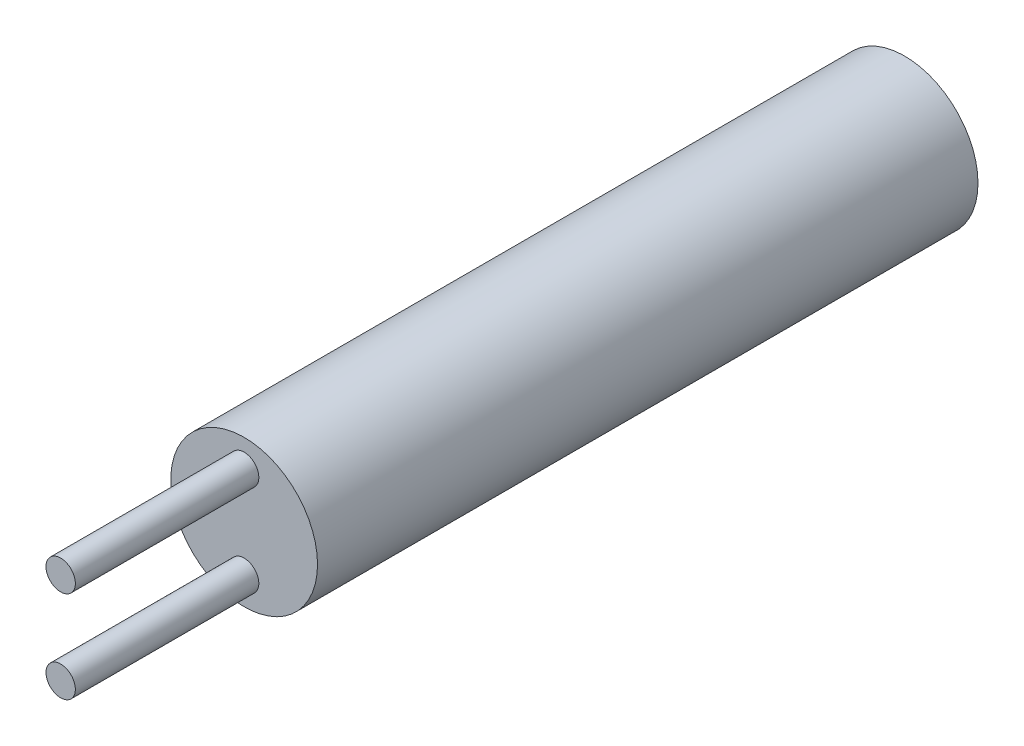
ISO-10303-21;
HEADER;
FILE_DESCRIPTION(('STEP AP214'),'2;1');
FILE_NAME('part.step','',(''),(''),'','','');
FILE_SCHEMA(('AUTOMOTIVE_DESIGN { 1 0 10303 214 1 1 1 1 }'));
ENDSEC;
DATA;
#1=APPLICATION_CONTEXT('core data for automotive mechanical design processes');
#2=APPLICATION_PROTOCOL_DEFINITION('international standard','automotive_design',2000,#1);
#3=PRODUCT_CONTEXT('',#1,'mechanical');
#4=PRODUCT('Part','Part','',(#3));
#5=PRODUCT_RELATED_PRODUCT_CATEGORY('part','',(#4));
#6=PRODUCT_DEFINITION_FORMATION('','',#4);
#7=PRODUCT_DEFINITION_CONTEXT('part definition',#1,'design');
#8=PRODUCT_DEFINITION('design','',#6,#7);
#9=PRODUCT_DEFINITION_SHAPE('','',#8);
#10=(LENGTH_UNIT() NAMED_UNIT(*) SI_UNIT(.MILLI.,.METRE.));
#11=(NAMED_UNIT(*) PLANE_ANGLE_UNIT() SI_UNIT($,.RADIAN.));
#12=(NAMED_UNIT(*) SI_UNIT($,.STERADIAN.) SOLID_ANGLE_UNIT());
#13=UNCERTAINTY_MEASURE_WITH_UNIT(LENGTH_MEASURE(1.E-05),#10,'distance_accuracy_value','');
#14=(GEOMETRIC_REPRESENTATION_CONTEXT(3) GLOBAL_UNCERTAINTY_ASSIGNED_CONTEXT((#13)) GLOBAL_UNIT_ASSIGNED_CONTEXT((#10,
#11,#12)) REPRESENTATION_CONTEXT('',''));
#15=CARTESIAN_POINT('',(0.,0.,0.));
#16=DIRECTION('',(0.,0.,1.));
#17=DIRECTION('',(1.,0.,0.));
#18=AXIS2_PLACEMENT_3D('',#15,#16,#17);
#19=CARTESIAN_POINT('',(0.,0.,18.));
#20=DIRECTION('',(0.,0.,-1.));
#21=DIRECTION('',(-1.,0.,0.));
#22=AXIS2_PLACEMENT_3D('',#19,#20,#21);
#23=CYLINDRICAL_SURFACE('',#22,2.);
#24=CARTESIAN_POINT('',(0.,0.,18.));
#25=DIRECTION('',(0.,0.,1.));
#26=DIRECTION('',(1.,0.,0.));
#27=AXIS2_PLACEMENT_3D('',#24,#25,#26);
#28=CIRCLE('',#27,2.);
#29=CARTESIAN_POINT('',(2.,0.,18.));
#30=VERTEX_POINT('',#29);
#31=EDGE_CURVE('E10',#30,#30,#28,.T.);
#32=ORIENTED_EDGE('',*,*,#31,.F.);
#33=EDGE_LOOP('',(#32));
#34=FACE_BOUND('',#33,.T.);
#35=CARTESIAN_POINT('',(0.,0.,0.));
#36=DIRECTION('',(0.,0.,1.));
#37=DIRECTION('',(1.,0.,0.));
#38=AXIS2_PLACEMENT_3D('',#35,#36,#37);
#39=CIRCLE('',#38,2.);
#40=CARTESIAN_POINT('',(2.,0.,0.));
#41=VERTEX_POINT('',#40);
#42=EDGE_CURVE('E42',#41,#41,#39,.T.);
#43=ORIENTED_EDGE('',*,*,#42,.T.);
#44=EDGE_LOOP('',(#43));
#45=FACE_BOUND('',#44,.T.);
#46=ADVANCED_FACE('F39',(#34,#45),#23,.T.);
#47=CARTESIAN_POINT('',(0.,0.,18.));
#48=DIRECTION('',(0.,0.,1.));
#49=DIRECTION('',(1.,0.,0.));
#50=AXIS2_PLACEMENT_3D('',#47,#48,#49);
#51=PLANE('',#50);
#52=CARTESIAN_POINT('',(0.,-1.25,18.));
#53=DIRECTION('',(0.,0.,1.));
#54=DIRECTION('',(-1.,0.,0.));
#55=AXIS2_PLACEMENT_3D('',#52,#53,#54);
#56=CIRCLE('',#55,0.4);
#57=CARTESIAN_POINT('',(-0.4,-1.25,18.));
#58=VERTEX_POINT('',#57);
#59=EDGE_CURVE('E61',#58,#58,#56,.T.);
#60=ORIENTED_EDGE('',*,*,#59,.F.);
#61=EDGE_LOOP('',(#60));
#62=FACE_BOUND('',#61,.T.);
#63=CARTESIAN_POINT('',(0.,1.25,18.));
#64=DIRECTION('',(0.,0.,1.));
#65=DIRECTION('',(1.,0.,0.));
#66=AXIS2_PLACEMENT_3D('',#63,#64,#65);
#67=CIRCLE('',#66,0.4);
#68=CARTESIAN_POINT('',(0.4,1.25,18.));
#69=VERTEX_POINT('',#68);
#70=EDGE_CURVE('E53',#69,#69,#67,.T.);
#71=ORIENTED_EDGE('',*,*,#70,.F.);
#72=EDGE_LOOP('',(#71));
#73=FACE_BOUND('',#72,.T.);
#74=ORIENTED_EDGE('',*,*,#31,.T.);
#75=EDGE_LOOP('',(#74));
#76=FACE_BOUND('',#75,.T.);
#77=ADVANCED_FACE('F78',(#62,#73,#76),#51,.T.);
#78=CARTESIAN_POINT('',(0.,0.,0.));
#79=DIRECTION('',(0.,0.,1.));
#80=DIRECTION('',(1.,0.,0.));
#81=AXIS2_PLACEMENT_3D('',#78,#79,#80);
#82=PLANE('',#81);
#83=ORIENTED_EDGE('',*,*,#42,.F.);
#84=EDGE_LOOP('',(#83));
#85=FACE_BOUND('',#84,.T.);
#86=ADVANCED_FACE('F81',(#85),#82,.F.);
#87=CARTESIAN_POINT('',(0.,1.25,23.));
#88=DIRECTION('',(0.,0.,-1.));
#89=DIRECTION('',(-1.,0.,0.));
#90=AXIS2_PLACEMENT_3D('',#87,#88,#89);
#91=CYLINDRICAL_SURFACE('',#90,0.4);
#92=CARTESIAN_POINT('',(0.,1.25,23.));
#93=DIRECTION('',(0.,0.,1.));
#94=DIRECTION('',(1.,0.,0.));
#95=AXIS2_PLACEMENT_3D('',#92,#93,#94);
#96=CIRCLE('',#95,0.4);
#97=CARTESIAN_POINT('',(0.4,1.25,23.));
#98=VERTEX_POINT('',#97);
#99=EDGE_CURVE('E51',#98,#98,#96,.T.);
#100=ORIENTED_EDGE('',*,*,#99,.F.);
#101=EDGE_LOOP('',(#100));
#102=FACE_BOUND('',#101,.T.);
#103=ORIENTED_EDGE('',*,*,#70,.T.);
#104=EDGE_LOOP('',(#103));
#105=FACE_BOUND('',#104,.T.);
#106=ADVANCED_FACE('F85',(#102,#105),#91,.T.);
#107=CARTESIAN_POINT('',(0.,1.25,23.));
#108=DIRECTION('',(0.,0.,1.));
#109=DIRECTION('',(1.,0.,0.));
#110=AXIS2_PLACEMENT_3D('',#107,#108,#109);
#111=PLANE('',#110);
#112=ORIENTED_EDGE('',*,*,#99,.T.);
#113=EDGE_LOOP('',(#112));
#114=FACE_BOUND('',#113,.T.);
#115=ADVANCED_FACE('F74',(#114),#111,.T.);
#116=CARTESIAN_POINT('',(0.,-1.25,23.));
#117=DIRECTION('',(0.,0.,-1.));
#118=DIRECTION('',(-1.,0.,0.));
#119=AXIS2_PLACEMENT_3D('',#116,#117,#118);
#120=CYLINDRICAL_SURFACE('',#119,0.4);
#121=CARTESIAN_POINT('',(0.,-1.25,23.));
#122=DIRECTION('',(0.,0.,1.));
#123=DIRECTION('',(-1.,0.,0.));
#124=AXIS2_PLACEMENT_3D('',#121,#122,#123);
#125=CIRCLE('',#124,0.4);
#126=CARTESIAN_POINT('',(-0.4,-1.25,23.));
#127=VERTEX_POINT('',#126);
#128=EDGE_CURVE('E57',#127,#127,#125,.T.);
#129=ORIENTED_EDGE('',*,*,#128,.F.);
#130=EDGE_LOOP('',(#129));
#131=FACE_BOUND('',#130,.T.);
#132=ORIENTED_EDGE('',*,*,#59,.T.);
#133=EDGE_LOOP('',(#132));
#134=FACE_BOUND('',#133,.T.);
#135=ADVANCED_FACE('F71',(#131,#134),#120,.T.);
#136=CARTESIAN_POINT('',(0.,-1.25,23.));
#137=DIRECTION('',(0.,0.,-1.));
#138=DIRECTION('',(-1.,0.,0.));
#139=AXIS2_PLACEMENT_3D('',#136,#137,#138);
#140=PLANE('',#139);
#141=ORIENTED_EDGE('',*,*,#128,.T.);
#142=EDGE_LOOP('',(#141));
#143=FACE_BOUND('',#142,.T.);
#144=ADVANCED_FACE('F69',(#143),#140,.F.);
#145=CLOSED_SHELL('',(#46,#77,#86,#106,#115,#135,#144));
#146=MANIFOLD_SOLID_BREP('B2',#145);
#147=ADVANCED_BREP_SHAPE_REPRESENTATION('',(#18,#146),#14);
#148=SHAPE_DEFINITION_REPRESENTATION(#9,#147);
ENDSEC;
END-ISO-10303-21;
